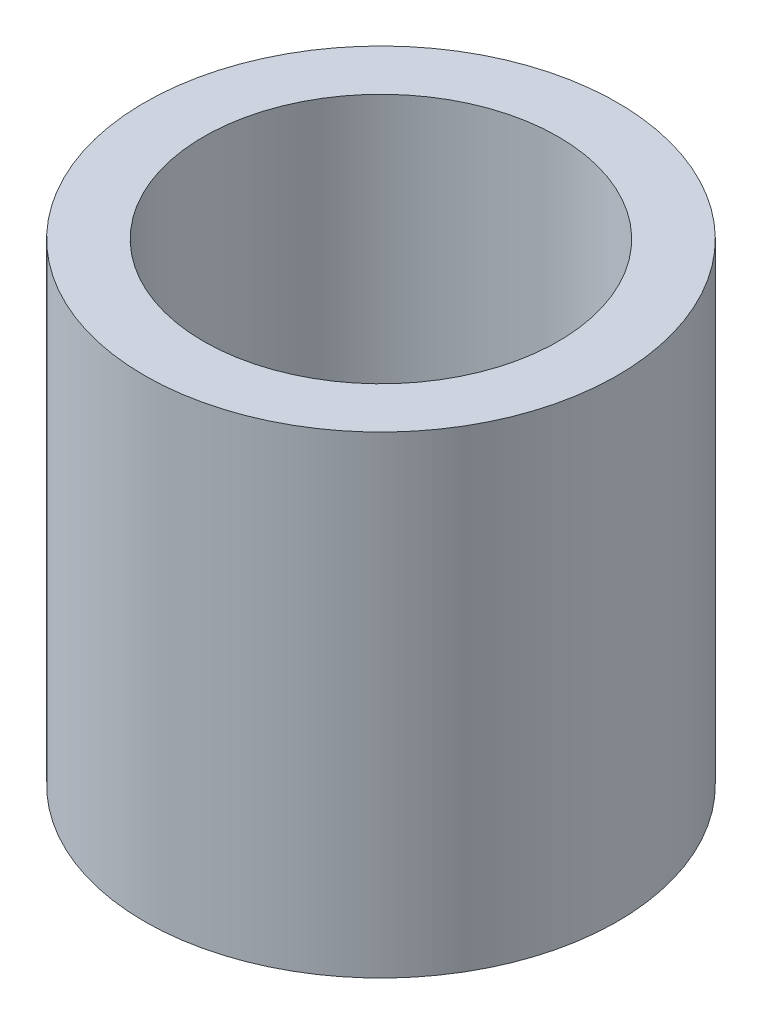
ISO-10303-21;
HEADER;
FILE_DESCRIPTION(('STEP AP214'),'2;1');
FILE_NAME('part.step','',(''),(''),'','','');
FILE_SCHEMA(('AUTOMOTIVE_DESIGN { 1 0 10303 214 1 1 1 1 }'));
ENDSEC;
DATA;
#1=APPLICATION_CONTEXT('core data for automotive mechanical design processes');
#2=APPLICATION_PROTOCOL_DEFINITION('international standard','automotive_design',2000,#1);
#3=PRODUCT_CONTEXT('',#1,'mechanical');
#4=PRODUCT('Part','Part','',(#3));
#5=PRODUCT_RELATED_PRODUCT_CATEGORY('part','',(#4));
#6=PRODUCT_DEFINITION_FORMATION('','',#4);
#7=PRODUCT_DEFINITION_CONTEXT('part definition',#1,'design');
#8=PRODUCT_DEFINITION('design','',#6,#7);
#9=PRODUCT_DEFINITION_SHAPE('','',#8);
#10=(LENGTH_UNIT() NAMED_UNIT(*) SI_UNIT(.MILLI.,.METRE.));
#11=(NAMED_UNIT(*) PLANE_ANGLE_UNIT() SI_UNIT($,.RADIAN.));
#12=(NAMED_UNIT(*) SI_UNIT($,.STERADIAN.) SOLID_ANGLE_UNIT());
#13=UNCERTAINTY_MEASURE_WITH_UNIT(LENGTH_MEASURE(1.E-05),#10,'distance_accuracy_value','');
#14=(GEOMETRIC_REPRESENTATION_CONTEXT(3) GLOBAL_UNCERTAINTY_ASSIGNED_CONTEXT((#13)) GLOBAL_UNIT_ASSIGNED_CONTEXT((#10,
#11,#12)) REPRESENTATION_CONTEXT('',''));
#15=CARTESIAN_POINT('',(0.,0.,0.));
#16=DIRECTION('',(0.,0.,1.));
#17=DIRECTION('',(1.,0.,0.));
#18=AXIS2_PLACEMENT_3D('',#15,#16,#17);
#19=CARTESIAN_POINT('',(0.,10.,0.));
#20=DIRECTION('',(0.,1.,0.));
#21=DIRECTION('',(0.,0.,1.));
#22=AXIS2_PLACEMENT_3D('',#19,#20,#21);
#23=PLANE('',#22);
#24=CARTESIAN_POINT('',(0.,10.,0.));
#25=DIRECTION('',(0.,1.,0.));
#26=DIRECTION('',(0.,0.,1.));
#27=AXIS2_PLACEMENT_3D('',#24,#25,#26);
#28=CIRCLE('',#27,10.);
#29=CARTESIAN_POINT('',(0.,10.,10.));
#30=VERTEX_POINT('',#29);
#31=EDGE_CURVE('E10',#30,#30,#28,.T.);
#32=ORIENTED_EDGE('',*,*,#31,.T.);
#33=EDGE_LOOP('',(#32));
#34=FACE_BOUND('',#33,.T.);
#35=CARTESIAN_POINT('',(0.,10.,0.));
#36=DIRECTION('',(0.,1.,0.));
#37=DIRECTION('',(0.,0.,1.));
#38=AXIS2_PLACEMENT_3D('',#35,#36,#37);
#39=CIRCLE('',#38,7.5);
#40=CARTESIAN_POINT('',(0.,10.,7.5));
#41=VERTEX_POINT('',#40);
#42=EDGE_CURVE('E40',#41,#41,#39,.T.);
#43=ORIENTED_EDGE('',*,*,#42,.F.);
#44=EDGE_LOOP('',(#43));
#45=FACE_BOUND('',#44,.T.);
#46=ADVANCED_FACE('F29',(#34,#45),#23,.T.);
#47=CARTESIAN_POINT('',(0.,-10.,0.));
#48=DIRECTION('',(0.,1.,0.));
#49=DIRECTION('',(0.,0.,1.));
#50=AXIS2_PLACEMENT_3D('',#47,#48,#49);
#51=PLANE('',#50);
#52=CARTESIAN_POINT('',(0.,-10.,0.));
#53=DIRECTION('',(0.,1.,0.));
#54=DIRECTION('',(0.,0.,1.));
#55=AXIS2_PLACEMENT_3D('',#52,#53,#54);
#56=CIRCLE('',#55,10.);
#57=CARTESIAN_POINT('',(0.,-10.,10.));
#58=VERTEX_POINT('',#57);
#59=EDGE_CURVE('E33',#58,#58,#56,.T.);
#60=ORIENTED_EDGE('',*,*,#59,.F.);
#61=EDGE_LOOP('',(#60));
#62=FACE_BOUND('',#61,.T.);
#63=CARTESIAN_POINT('',(0.,-10.,0.));
#64=DIRECTION('',(0.,1.,0.));
#65=DIRECTION('',(0.,0.,1.));
#66=AXIS2_PLACEMENT_3D('',#63,#64,#65);
#67=CIRCLE('',#66,7.5);
#68=CARTESIAN_POINT('',(0.,-10.,7.5));
#69=VERTEX_POINT('',#68);
#70=EDGE_CURVE('E42',#69,#69,#67,.T.);
#71=ORIENTED_EDGE('',*,*,#70,.T.);
#72=EDGE_LOOP('',(#71));
#73=FACE_BOUND('',#72,.T.);
#74=ADVANCED_FACE('F52',(#62,#73),#51,.F.);
#75=CARTESIAN_POINT('',(0.,10.,0.));
#76=DIRECTION('',(0.,-1.,0.));
#77=DIRECTION('',(0.,0.,-1.));
#78=AXIS2_PLACEMENT_3D('',#75,#76,#77);
#79=CYLINDRICAL_SURFACE('',#78,10.);
#80=ORIENTED_EDGE('',*,*,#31,.F.);
#81=EDGE_LOOP('',(#80));
#82=FACE_BOUND('',#81,.T.);
#83=ORIENTED_EDGE('',*,*,#59,.T.);
#84=EDGE_LOOP('',(#83));
#85=FACE_BOUND('',#84,.T.);
#86=ADVANCED_FACE('F31',(#82,#85),#79,.T.);
#87=CARTESIAN_POINT('',(0.,10.,0.));
#88=DIRECTION('',(0.,-1.,0.));
#89=DIRECTION('',(0.,0.,-1.));
#90=AXIS2_PLACEMENT_3D('',#87,#88,#89);
#91=CYLINDRICAL_SURFACE('',#90,7.5);
#92=ORIENTED_EDGE('',*,*,#42,.T.);
#93=EDGE_LOOP('',(#92));
#94=FACE_BOUND('',#93,.T.);
#95=ORIENTED_EDGE('',*,*,#70,.F.);
#96=EDGE_LOOP('',(#95));
#97=FACE_BOUND('',#96,.T.);
#98=ADVANCED_FACE('F48',(#94,#97),#91,.F.);
#99=CLOSED_SHELL('',(#46,#74,#86,#98));
#100=MANIFOLD_SOLID_BREP('B2',#99);
#101=ADVANCED_BREP_SHAPE_REPRESENTATION('',(#18,#100),#14);
#102=SHAPE_DEFINITION_REPRESENTATION(#9,#101);
ENDSEC;
END-ISO-10303-21;
